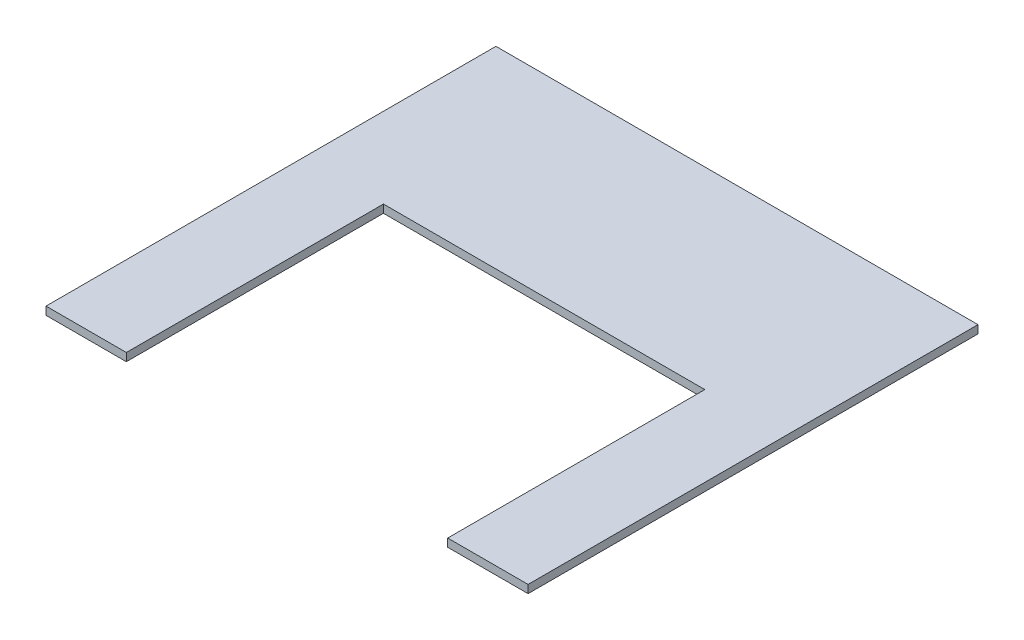
ISO-10303-21;
HEADER;
FILE_DESCRIPTION(('STEP AP214'),'2;1');
FILE_NAME('part.step','',(''),(''),'','','');
FILE_SCHEMA(('AUTOMOTIVE_DESIGN { 1 0 10303 214 1 1 1 1 }'));
ENDSEC;
DATA;
#1=APPLICATION_CONTEXT('core data for automotive mechanical design processes');
#2=APPLICATION_PROTOCOL_DEFINITION('international standard','automotive_design',2000,#1);
#3=PRODUCT_CONTEXT('',#1,'mechanical');
#4=PRODUCT('Part','Part','',(#3));
#5=PRODUCT_RELATED_PRODUCT_CATEGORY('part','',(#4));
#6=PRODUCT_DEFINITION_FORMATION('','',#4);
#7=PRODUCT_DEFINITION_CONTEXT('part definition',#1,'design');
#8=PRODUCT_DEFINITION('design','',#6,#7);
#9=PRODUCT_DEFINITION_SHAPE('','',#8);
#10=(LENGTH_UNIT() NAMED_UNIT(*) SI_UNIT(.MILLI.,.METRE.));
#11=(NAMED_UNIT(*) PLANE_ANGLE_UNIT() SI_UNIT($,.RADIAN.));
#12=(NAMED_UNIT(*) SI_UNIT($,.STERADIAN.) SOLID_ANGLE_UNIT());
#13=UNCERTAINTY_MEASURE_WITH_UNIT(LENGTH_MEASURE(1.E-05),#10,'distance_accuracy_value','');
#14=(GEOMETRIC_REPRESENTATION_CONTEXT(3) GLOBAL_UNCERTAINTY_ASSIGNED_CONTEXT((#13)) GLOBAL_UNIT_ASSIGNED_CONTEXT((#10,
#11,#12)) REPRESENTATION_CONTEXT('',''));
#15=CARTESIAN_POINT('',(0.,0.,0.));
#16=DIRECTION('',(0.,0.,1.));
#17=DIRECTION('',(1.,0.,0.));
#18=AXIS2_PLACEMENT_3D('',#15,#16,#17);
#19=CARTESIAN_POINT('',(0.,6.35,0.));
#20=DIRECTION('',(1.,0.,0.));
#21=DIRECTION('',(0.,0.,-1.));
#22=AXIS2_PLACEMENT_3D('',#19,#20,#21);
#23=PLANE('',#22);
#24=DIRECTION('',(0.,0.,1.));
#25=VECTOR('',#24,1.);
#26=CARTESIAN_POINT('',(0.,0.,0.));
#27=LINE('',#26,#25);
#28=CARTESIAN_POINT('',(0.,0.,-429.26));
#29=VERTEX_POINT('',#28);
#30=CARTESIAN_POINT('',(0.,0.,-73.66));
#31=VERTEX_POINT('',#30);
#32=EDGE_CURVE('E136',#29,#31,#27,.T.);
#33=ORIENTED_EDGE('',*,*,#32,.T.);
#34=DIRECTION('',(0.,1.,0.));
#35=VECTOR('',#34,1.);
#36=CARTESIAN_POINT('',(0.,0.,-73.66));
#37=LINE('',#36,#35);
#38=CARTESIAN_POINT('',(0.,6.35,-73.66));
#39=VERTEX_POINT('',#38);
#40=EDGE_CURVE('E129',#31,#39,#37,.T.);
#41=ORIENTED_EDGE('',*,*,#40,.T.);
#42=DIRECTION('',(0.,0.,1.));
#43=VECTOR('',#42,1.);
#44=CARTESIAN_POINT('',(0.,6.35,0.));
#45=LINE('',#44,#43);
#46=CARTESIAN_POINT('',(0.,6.35,-429.26));
#47=VERTEX_POINT('',#46);
#48=EDGE_CURVE('E139',#47,#39,#45,.T.);
#49=ORIENTED_EDGE('',*,*,#48,.F.);
#50=DIRECTION('',(0.,-1.,0.));
#51=VECTOR('',#50,1.);
#52=CARTESIAN_POINT('',(0.,6.35,-429.26));
#53=LINE('',#52,#51);
#54=EDGE_CURVE('E147',#47,#29,#53,.T.);
#55=ORIENTED_EDGE('',*,*,#54,.T.);
#56=EDGE_LOOP('',(#33,#41,#49,#55));
#57=FACE_BOUND('',#56,.T.);
#58=ADVANCED_FACE('F32',(#57),#23,.F.);
#59=CARTESIAN_POINT('',(381.,6.35,0.));
#60=DIRECTION('',(-1.,0.,0.));
#61=DIRECTION('',(0.,0.,1.));
#62=AXIS2_PLACEMENT_3D('',#59,#60,#61);
#63=PLANE('',#62);
#64=DIRECTION('',(0.,0.,-1.));
#65=VECTOR('',#64,1.);
#66=CARTESIAN_POINT('',(381.,6.35,0.));
#67=LINE('',#66,#65);
#68=CARTESIAN_POINT('',(381.,6.35,-73.66));
#69=VERTEX_POINT('',#68);
#70=CARTESIAN_POINT('',(381.,6.35,-429.26));
#71=VERTEX_POINT('',#70);
#72=EDGE_CURVE('E142',#69,#71,#67,.T.);
#73=ORIENTED_EDGE('',*,*,#72,.F.);
#74=DIRECTION('',(0.,1.,0.));
#75=VECTOR('',#74,1.);
#76=CARTESIAN_POINT('',(381.,0.,-73.66));
#77=LINE('',#76,#75);
#78=CARTESIAN_POINT('',(381.,0.,-73.66));
#79=VERTEX_POINT('',#78);
#80=EDGE_CURVE('E127',#79,#69,#77,.T.);
#81=ORIENTED_EDGE('',*,*,#80,.F.);
#82=DIRECTION('',(0.,0.,-1.));
#83=VECTOR('',#82,1.);
#84=CARTESIAN_POINT('',(381.,0.,0.));
#85=LINE('',#84,#83);
#86=CARTESIAN_POINT('',(381.,0.,-429.26));
#87=VERTEX_POINT('',#86);
#88=EDGE_CURVE('E150',#79,#87,#85,.T.);
#89=ORIENTED_EDGE('',*,*,#88,.T.);
#90=DIRECTION('',(0.,-1.,0.));
#91=VECTOR('',#90,1.);
#92=CARTESIAN_POINT('',(381.,6.35,-429.26));
#93=LINE('',#92,#91);
#94=EDGE_CURVE('E39',#71,#87,#93,.T.);
#95=ORIENTED_EDGE('',*,*,#94,.F.);
#96=EDGE_LOOP('',(#73,#81,#89,#95));
#97=FACE_BOUND('',#96,.T.);
#98=ADVANCED_FACE('F172',(#97),#63,.F.);
#99=CARTESIAN_POINT('',(0.,6.35,-429.26));
#100=DIRECTION('',(0.,0.,1.));
#101=DIRECTION('',(1.,0.,0.));
#102=AXIS2_PLACEMENT_3D('',#99,#100,#101);
#103=PLANE('',#102);
#104=DIRECTION('',(-1.,0.,0.));
#105=VECTOR('',#104,1.);
#106=CARTESIAN_POINT('',(0.,0.,-429.26));
#107=LINE('',#106,#105);
#108=EDGE_CURVE('E143',#87,#29,#107,.T.);
#109=ORIENTED_EDGE('',*,*,#108,.T.);
#110=ORIENTED_EDGE('',*,*,#54,.F.);
#111=DIRECTION('',(-1.,0.,0.));
#112=VECTOR('',#111,1.);
#113=CARTESIAN_POINT('',(0.,6.35,-429.26));
#114=LINE('',#113,#112);
#115=EDGE_CURVE('E145',#71,#47,#114,.T.);
#116=ORIENTED_EDGE('',*,*,#115,.F.);
#117=ORIENTED_EDGE('',*,*,#94,.T.);
#118=EDGE_LOOP('',(#109,#110,#116,#117));
#119=FACE_BOUND('',#118,.T.);
#120=ADVANCED_FACE('F159',(#119),#103,.F.);
#121=CARTESIAN_POINT('',(0.,6.35,0.));
#122=DIRECTION('',(0.,-1.,0.));
#123=DIRECTION('',(0.,0.,-1.));
#124=AXIS2_PLACEMENT_3D('',#121,#122,#123);
#125=PLANE('',#124);
#126=DIRECTION('',(0.,0.,1.));
#127=VECTOR('',#126,1.);
#128=CARTESIAN_POINT('',(63.5,6.35,-203.2));
#129=LINE('',#128,#127);
#130=CARTESIAN_POINT('',(63.5,6.35,-276.86));
#131=VERTEX_POINT('',#130);
#132=CARTESIAN_POINT('',(63.5,6.35,-73.66));
#133=VERTEX_POINT('',#132);
#134=EDGE_CURVE('E133',#131,#133,#129,.T.);
#135=ORIENTED_EDGE('',*,*,#134,.F.);
#136=DIRECTION('',(-1.,0.,0.));
#137=VECTOR('',#136,1.);
#138=CARTESIAN_POINT('',(63.5,6.35,-276.86));
#139=LINE('',#138,#137);
#140=CARTESIAN_POINT('',(317.5,6.35,-276.86));
#141=VERTEX_POINT('',#140);
#142=EDGE_CURVE('E113',#141,#131,#139,.T.);
#143=ORIENTED_EDGE('',*,*,#142,.F.);
#144=DIRECTION('',(0.,0.,-1.));
#145=VECTOR('',#144,1.);
#146=CARTESIAN_POINT('',(317.5,6.35,-203.2));
#147=LINE('',#146,#145);
#148=CARTESIAN_POINT('',(317.5,6.35,-73.66));
#149=VERTEX_POINT('',#148);
#150=EDGE_CURVE('E105',#149,#141,#147,.T.);
#151=ORIENTED_EDGE('',*,*,#150,.F.);
#152=DIRECTION('',(-1.,0.,0.));
#153=VECTOR('',#152,1.);
#154=CARTESIAN_POINT('',(0.,6.35,-73.66));
#155=LINE('',#154,#153);
#156=EDGE_CURVE('E54',#69,#149,#155,.T.);
#157=ORIENTED_EDGE('',*,*,#156,.F.);
#158=ORIENTED_EDGE('',*,*,#72,.T.);
#159=ORIENTED_EDGE('',*,*,#115,.T.);
#160=ORIENTED_EDGE('',*,*,#48,.T.);
#161=EDGE_CURVE('E124',#133,#39,#155,.T.);
#162=ORIENTED_EDGE('',*,*,#161,.F.);
#163=EDGE_LOOP('',(#135,#143,#151,#157,#158,#159,#160,#162));
#164=FACE_BOUND('',#163,.T.);
#165=ADVANCED_FACE('F169',(#164),#125,.F.);
#166=CARTESIAN_POINT('',(0.,0.,0.));
#167=DIRECTION('',(0.,-1.,0.));
#168=DIRECTION('',(0.,0.,-1.));
#169=AXIS2_PLACEMENT_3D('',#166,#167,#168);
#170=PLANE('',#169);
#171=DIRECTION('',(1.,0.,0.));
#172=VECTOR('',#171,1.);
#173=CARTESIAN_POINT('',(63.5,0.,-276.86));
#174=LINE('',#173,#172);
#175=CARTESIAN_POINT('',(63.5,0.,-276.86));
#176=VERTEX_POINT('',#175);
#177=CARTESIAN_POINT('',(317.5,0.,-276.86));
#178=VERTEX_POINT('',#177);
#179=EDGE_CURVE('E111',#176,#178,#174,.T.);
#180=ORIENTED_EDGE('',*,*,#179,.F.);
#181=DIRECTION('',(0.,0.,1.));
#182=VECTOR('',#181,1.);
#183=CARTESIAN_POINT('',(63.5,0.,-203.2));
#184=LINE('',#183,#182);
#185=CARTESIAN_POINT('',(63.5,0.,-73.66));
#186=VERTEX_POINT('',#185);
#187=EDGE_CURVE('E95',#176,#186,#184,.T.);
#188=ORIENTED_EDGE('',*,*,#187,.T.);
#189=DIRECTION('',(-1.,0.,0.));
#190=VECTOR('',#189,1.);
#191=CARTESIAN_POINT('',(0.,0.,-73.66));
#192=LINE('',#191,#190);
#193=EDGE_CURVE('E46',#186,#31,#192,.T.);
#194=ORIENTED_EDGE('',*,*,#193,.T.);
#195=ORIENTED_EDGE('',*,*,#32,.F.);
#196=ORIENTED_EDGE('',*,*,#108,.F.);
#197=ORIENTED_EDGE('',*,*,#88,.F.);
#198=CARTESIAN_POINT('',(317.5,0.,-73.66));
#199=VERTEX_POINT('',#198);
#200=EDGE_CURVE('E125',#79,#199,#192,.T.);
#201=ORIENTED_EDGE('',*,*,#200,.T.);
#202=DIRECTION('',(0.,0.,-1.));
#203=VECTOR('',#202,1.);
#204=CARTESIAN_POINT('',(317.5,0.,-203.2));
#205=LINE('',#204,#203);
#206=EDGE_CURVE('E104',#199,#178,#205,.T.);
#207=ORIENTED_EDGE('',*,*,#206,.T.);
#208=EDGE_LOOP('',(#180,#188,#194,#195,#196,#197,#201,#207));
#209=FACE_BOUND('',#208,.T.);
#210=ADVANCED_FACE('F115',(#209),#170,.T.);
#211=CARTESIAN_POINT('',(63.5,0.,-203.2));
#212=DIRECTION('',(-1.,0.,0.));
#213=DIRECTION('',(0.,0.,1.));
#214=AXIS2_PLACEMENT_3D('',#211,#212,#213);
#215=PLANE('',#214);
#216=ORIENTED_EDGE('',*,*,#134,.T.);
#217=DIRECTION('',(0.,-1.,0.));
#218=VECTOR('',#217,1.);
#219=CARTESIAN_POINT('',(63.5,0.,-73.66));
#220=LINE('',#219,#218);
#221=EDGE_CURVE('E101',#133,#186,#220,.T.);
#222=ORIENTED_EDGE('',*,*,#221,.T.);
#223=ORIENTED_EDGE('',*,*,#187,.F.);
#224=DIRECTION('',(0.,-1.,0.));
#225=VECTOR('',#224,1.);
#226=CARTESIAN_POINT('',(63.5,0.,-276.86));
#227=LINE('',#226,#225);
#228=EDGE_CURVE('E99',#131,#176,#227,.T.);
#229=ORIENTED_EDGE('',*,*,#228,.F.);
#230=EDGE_LOOP('',(#216,#222,#223,#229));
#231=FACE_BOUND('',#230,.T.);
#232=ADVANCED_FACE('F98',(#231),#215,.F.);
#233=CARTESIAN_POINT('',(317.5,0.,-203.2));
#234=DIRECTION('',(1.,0.,0.));
#235=DIRECTION('',(0.,0.,-1.));
#236=AXIS2_PLACEMENT_3D('',#233,#234,#235);
#237=PLANE('',#236);
#238=ORIENTED_EDGE('',*,*,#206,.F.);
#239=DIRECTION('',(0.,1.,0.));
#240=VECTOR('',#239,1.);
#241=CARTESIAN_POINT('',(317.5,0.,-73.66));
#242=LINE('',#241,#240);
#243=EDGE_CURVE('E11',#199,#149,#242,.T.);
#244=ORIENTED_EDGE('',*,*,#243,.T.);
#245=ORIENTED_EDGE('',*,*,#150,.T.);
#246=DIRECTION('',(0.,1.,0.));
#247=VECTOR('',#246,1.);
#248=CARTESIAN_POINT('',(317.5,0.,-276.86));
#249=LINE('',#248,#247);
#250=EDGE_CURVE('E119',#178,#141,#249,.T.);
#251=ORIENTED_EDGE('',*,*,#250,.F.);
#252=EDGE_LOOP('',(#238,#244,#245,#251));
#253=FACE_BOUND('',#252,.T.);
#254=ADVANCED_FACE('F175',(#253),#237,.F.);
#255=CARTESIAN_POINT('',(0.,0.,-73.66));
#256=DIRECTION('',(0.,0.,-1.));
#257=DIRECTION('',(-1.,0.,0.));
#258=AXIS2_PLACEMENT_3D('',#255,#256,#257);
#259=PLANE('',#258);
#260=ORIENTED_EDGE('',*,*,#200,.F.);
#261=ORIENTED_EDGE('',*,*,#80,.T.);
#262=ORIENTED_EDGE('',*,*,#156,.T.);
#263=ORIENTED_EDGE('',*,*,#243,.F.);
#264=EDGE_LOOP('',(#260,#261,#262,#263));
#265=FACE_BOUND('',#264,.T.);
#266=ADVANCED_FACE('F173',(#265),#259,.F.);
#267=ORIENTED_EDGE('',*,*,#161,.T.);
#268=ORIENTED_EDGE('',*,*,#40,.F.);
#269=ORIENTED_EDGE('',*,*,#193,.F.);
#270=ORIENTED_EDGE('',*,*,#221,.F.);
#271=EDGE_LOOP('',(#267,#268,#269,#270));
#272=FACE_BOUND('',#271,.T.);
#273=ADVANCED_FACE('F182',(#272),#259,.F.);
#274=CARTESIAN_POINT('',(0.,0.,-276.86));
#275=DIRECTION('',(0.,0.,-1.));
#276=DIRECTION('',(-1.,0.,0.));
#277=AXIS2_PLACEMENT_3D('',#274,#275,#276);
#278=PLANE('',#277);
#279=ORIENTED_EDGE('',*,*,#228,.T.);
#280=ORIENTED_EDGE('',*,*,#179,.T.);
#281=ORIENTED_EDGE('',*,*,#250,.T.);
#282=ORIENTED_EDGE('',*,*,#142,.T.);
#283=EDGE_LOOP('',(#279,#280,#281,#282));
#284=FACE_BOUND('',#283,.T.);
#285=ADVANCED_FACE('F109',(#284),#278,.F.);
#286=CLOSED_SHELL('',(#58,#98,#120,#165,#210,#232,#254,#266,#273,#285));
#287=MANIFOLD_SOLID_BREP('B2',#286);
#288=ADVANCED_BREP_SHAPE_REPRESENTATION('',(#18,#287),#14);
#289=SHAPE_DEFINITION_REPRESENTATION(#9,#288);
ENDSEC;
END-ISO-10303-21;
